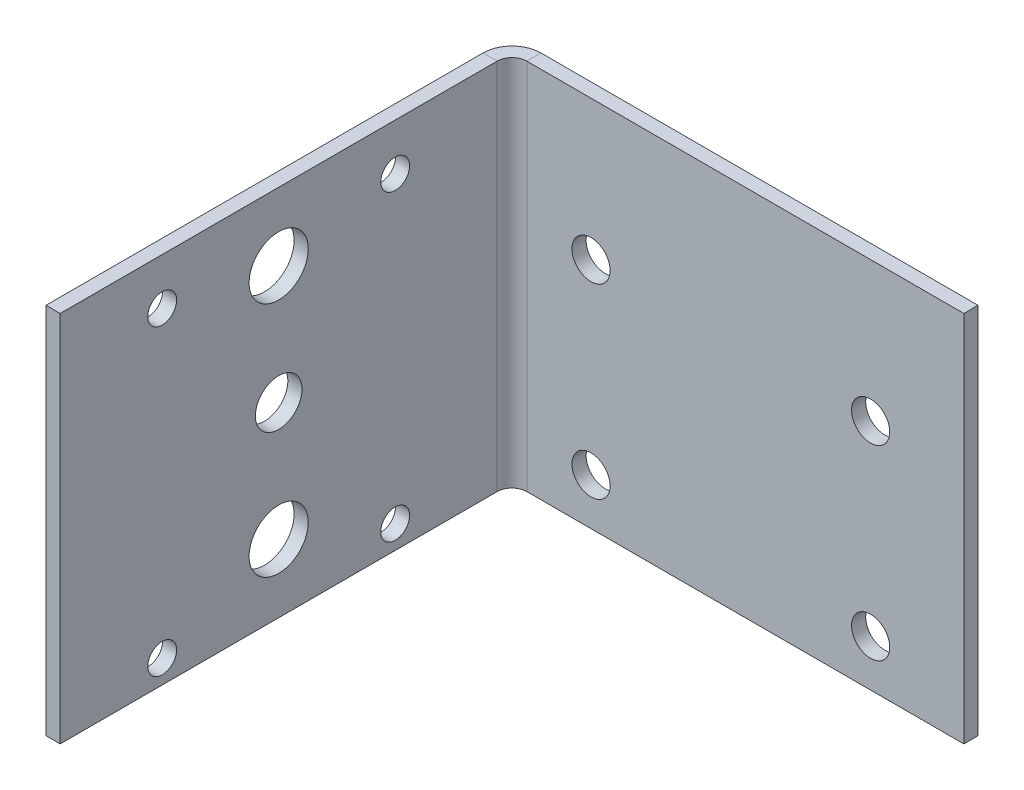
ISO-10303-21;
HEADER;
FILE_DESCRIPTION(('STEP AP214'),'2;1');
FILE_NAME('part.step','',(''),(''),'','','');
FILE_SCHEMA(('AUTOMOTIVE_DESIGN { 1 0 10303 214 1 1 1 1 }'));
ENDSEC;
DATA;
#1=APPLICATION_CONTEXT('core data for automotive mechanical design processes');
#2=APPLICATION_PROTOCOL_DEFINITION('international standard','automotive_design',2000,#1);
#3=PRODUCT_CONTEXT('',#1,'mechanical');
#4=PRODUCT('Part','Part','',(#3));
#5=PRODUCT_RELATED_PRODUCT_CATEGORY('part','',(#4));
#6=PRODUCT_DEFINITION_FORMATION('','',#4);
#7=PRODUCT_DEFINITION_CONTEXT('part definition',#1,'design');
#8=PRODUCT_DEFINITION('design','',#6,#7);
#9=PRODUCT_DEFINITION_SHAPE('','',#8);
#10=(LENGTH_UNIT() NAMED_UNIT(*) SI_UNIT(.MILLI.,.METRE.));
#11=(NAMED_UNIT(*) PLANE_ANGLE_UNIT() SI_UNIT($,.RADIAN.));
#12=(NAMED_UNIT(*) SI_UNIT($,.STERADIAN.) SOLID_ANGLE_UNIT());
#13=UNCERTAINTY_MEASURE_WITH_UNIT(LENGTH_MEASURE(1.E-05),#10,'distance_accuracy_value','');
#14=(GEOMETRIC_REPRESENTATION_CONTEXT(3) GLOBAL_UNCERTAINTY_ASSIGNED_CONTEXT((#13)) GLOBAL_UNIT_ASSIGNED_CONTEXT((#10,
#11,#12)) REPRESENTATION_CONTEXT('',''));
#15=CARTESIAN_POINT('',(0.,0.,0.));
#16=DIRECTION('',(0.,0.,1.));
#17=DIRECTION('',(1.,0.,0.));
#18=AXIS2_PLACEMENT_3D('',#15,#16,#17);
#19=CARTESIAN_POINT('',(-50.,-40.,-3.03784));
#20=DIRECTION('',(0.,-1.,0.));
#21=DIRECTION('',(0.,0.,-1.));
#22=AXIS2_PLACEMENT_3D('',#19,#20,#21);
#23=PLANE('',#22);
#24=DIRECTION('',(1.,0.,0.));
#25=VECTOR('',#24,1.);
#26=CARTESIAN_POINT('',(-50.,-40.,0.));
#27=LINE('',#26,#25);
#28=CARTESIAN_POINT('',(-43.78716,-40.,0.));
#29=VERTEX_POINT('',#28);
#30=CARTESIAN_POINT('',(50.,-40.,0.));
#31=VERTEX_POINT('',#30);
#32=EDGE_CURVE('E94',#29,#31,#27,.T.);
#33=ORIENTED_EDGE('',*,*,#32,.F.);
#34=DIRECTION('',(0.,0.,-1.));
#35=VECTOR('',#34,1.);
#36=CARTESIAN_POINT('',(-43.78716,-40.,0.));
#37=LINE('',#36,#35);
#38=CARTESIAN_POINT('',(-43.78716,-40.,-3.03784));
#39=VERTEX_POINT('',#38);
#40=EDGE_CURVE('E139',#29,#39,#37,.T.);
#41=ORIENTED_EDGE('',*,*,#40,.T.);
#42=DIRECTION('',(1.,0.,0.));
#43=VECTOR('',#42,1.);
#44=CARTESIAN_POINT('',(-50.,-40.,-3.03784));
#45=LINE('',#44,#43);
#46=CARTESIAN_POINT('',(50.,-40.,-3.03784));
#47=VERTEX_POINT('',#46);
#48=EDGE_CURVE('E83',#39,#47,#45,.T.);
#49=ORIENTED_EDGE('',*,*,#48,.T.);
#50=DIRECTION('',(0.,0.,1.));
#51=VECTOR('',#50,1.);
#52=CARTESIAN_POINT('',(50.,-40.,-3.03784));
#53=LINE('',#52,#51);
#54=EDGE_CURVE('E13',#47,#31,#53,.T.);
#55=ORIENTED_EDGE('',*,*,#54,.T.);
#56=EDGE_LOOP('',(#33,#41,#49,#55));
#57=FACE_BOUND('',#56,.T.);
#58=ADVANCED_FACE('F60',(#57),#23,.T.);
#59=CARTESIAN_POINT('',(0.,0.,-3.03784));
#60=DIRECTION('',(0.,0.,1.));
#61=DIRECTION('',(1.,0.,0.));
#62=AXIS2_PLACEMENT_3D('',#59,#60,#61);
#63=PLANE('',#62);
#64=CARTESIAN_POINT('',(-30.,10.,-3.03784));
#65=DIRECTION('',(0.,0.,1.));
#66=DIRECTION('',(1.,0.,0.));
#67=AXIS2_PLACEMENT_3D('',#64,#65,#66);
#68=CIRCLE('',#67,4.1);
#69=CARTESIAN_POINT('',(-25.9,10.,-3.03784));
#70=VERTEX_POINT('',#69);
#71=EDGE_CURVE('E106',#70,#70,#68,.T.);
#72=ORIENTED_EDGE('',*,*,#71,.T.);
#73=EDGE_LOOP('',(#72));
#74=FACE_BOUND('',#73,.T.);
#75=CARTESIAN_POINT('',(30.,10.,-3.03784));
#76=DIRECTION('',(0.,0.,1.));
#77=DIRECTION('',(1.,0.,0.));
#78=AXIS2_PLACEMENT_3D('',#75,#76,#77);
#79=CIRCLE('',#78,4.1);
#80=CARTESIAN_POINT('',(34.1,10.,-3.03784));
#81=VERTEX_POINT('',#80);
#82=EDGE_CURVE('E119',#81,#81,#79,.T.);
#83=ORIENTED_EDGE('',*,*,#82,.T.);
#84=EDGE_LOOP('',(#83));
#85=FACE_BOUND('',#84,.T.);
#86=CARTESIAN_POINT('',(-30.,-30.,-3.03784));
#87=DIRECTION('',(0.,0.,1.));
#88=DIRECTION('',(1.,0.,0.));
#89=AXIS2_PLACEMENT_3D('',#86,#87,#88);
#90=CIRCLE('',#89,4.1);
#91=CARTESIAN_POINT('',(-25.9,-30.,-3.03784));
#92=VERTEX_POINT('',#91);
#93=EDGE_CURVE('E124',#92,#92,#90,.T.);
#94=ORIENTED_EDGE('',*,*,#93,.T.);
#95=EDGE_LOOP('',(#94));
#96=FACE_BOUND('',#95,.T.);
#97=CARTESIAN_POINT('',(30.,-30.,-3.03784));
#98=DIRECTION('',(0.,0.,1.));
#99=DIRECTION('',(1.,0.,0.));
#100=AXIS2_PLACEMENT_3D('',#97,#98,#99);
#101=CIRCLE('',#100,4.1);
#102=CARTESIAN_POINT('',(34.1,-30.,-3.03784));
#103=VERTEX_POINT('',#102);
#104=EDGE_CURVE('E130',#103,#103,#101,.T.);
#105=ORIENTED_EDGE('',*,*,#104,.T.);
#106=EDGE_LOOP('',(#105));
#107=FACE_BOUND('',#106,.T.);
#108=DIRECTION('',(0.,-1.,0.));
#109=VECTOR('',#108,1.);
#110=CARTESIAN_POINT('',(-43.78716,-40.,-3.03784));
#111=LINE('',#110,#109);
#112=CARTESIAN_POINT('',(-43.78716,40.,-3.03784));
#113=VERTEX_POINT('',#112);
#114=EDGE_CURVE('E155',#39,#113,#111,.F.);
#115=ORIENTED_EDGE('',*,*,#114,.T.);
#116=DIRECTION('',(-1.,0.,0.));
#117=VECTOR('',#116,1.);
#118=CARTESIAN_POINT('',(-50.,40.,-3.03784));
#119=LINE('',#118,#117);
#120=CARTESIAN_POINT('',(50.,40.,-3.03784));
#121=VERTEX_POINT('',#120);
#122=EDGE_CURVE('E114',#121,#113,#119,.T.);
#123=ORIENTED_EDGE('',*,*,#122,.F.);
#124=DIRECTION('',(0.,1.,0.));
#125=VECTOR('',#124,1.);
#126=CARTESIAN_POINT('',(50.,40.,-3.03784));
#127=LINE('',#126,#125);
#128=EDGE_CURVE('E99',#47,#121,#127,.T.);
#129=ORIENTED_EDGE('',*,*,#128,.F.);
#130=ORIENTED_EDGE('',*,*,#48,.F.);
#131=EDGE_LOOP('',(#115,#123,#129,#130));
#132=FACE_BOUND('',#131,.T.);
#133=ADVANCED_FACE('F291',(#74,#85,#96,#107,#132),#63,.F.);
#134=CARTESIAN_POINT('',(0.,0.,0.));
#135=DIRECTION('',(0.,0.,1.));
#136=DIRECTION('',(1.,0.,0.));
#137=AXIS2_PLACEMENT_3D('',#134,#135,#136);
#138=PLANE('',#137);
#139=CARTESIAN_POINT('',(30.,-30.,0.));
#140=DIRECTION('',(0.,0.,1.));
#141=DIRECTION('',(1.,0.,0.));
#142=AXIS2_PLACEMENT_3D('',#139,#140,#141);
#143=CIRCLE('',#142,4.1);
#144=CARTESIAN_POINT('',(34.1,-30.,0.));
#145=VERTEX_POINT('',#144);
#146=EDGE_CURVE('E133',#145,#145,#143,.T.);
#147=ORIENTED_EDGE('',*,*,#146,.F.);
#148=EDGE_LOOP('',(#147));
#149=FACE_BOUND('',#148,.T.);
#150=CARTESIAN_POINT('',(-30.,-30.,0.));
#151=DIRECTION('',(0.,0.,1.));
#152=DIRECTION('',(1.,0.,0.));
#153=AXIS2_PLACEMENT_3D('',#150,#151,#152);
#154=CIRCLE('',#153,4.1);
#155=CARTESIAN_POINT('',(-25.9,-30.,0.));
#156=VERTEX_POINT('',#155);
#157=EDGE_CURVE('E127',#156,#156,#154,.T.);
#158=ORIENTED_EDGE('',*,*,#157,.F.);
#159=EDGE_LOOP('',(#158));
#160=FACE_BOUND('',#159,.T.);
#161=CARTESIAN_POINT('',(30.,10.,0.));
#162=DIRECTION('',(0.,0.,1.));
#163=DIRECTION('',(1.,0.,0.));
#164=AXIS2_PLACEMENT_3D('',#161,#162,#163);
#165=CIRCLE('',#164,4.1);
#166=CARTESIAN_POINT('',(34.1,10.,0.));
#167=VERTEX_POINT('',#166);
#168=EDGE_CURVE('E121',#167,#167,#165,.T.);
#169=ORIENTED_EDGE('',*,*,#168,.F.);
#170=EDGE_LOOP('',(#169));
#171=FACE_BOUND('',#170,.T.);
#172=CARTESIAN_POINT('',(-30.,10.,0.));
#173=DIRECTION('',(0.,0.,1.));
#174=DIRECTION('',(1.,0.,0.));
#175=AXIS2_PLACEMENT_3D('',#172,#173,#174);
#176=CIRCLE('',#175,4.1);
#177=CARTESIAN_POINT('',(-25.9,10.,0.));
#178=VERTEX_POINT('',#177);
#179=EDGE_CURVE('E110',#178,#178,#176,.T.);
#180=ORIENTED_EDGE('',*,*,#179,.F.);
#181=EDGE_LOOP('',(#180));
#182=FACE_BOUND('',#181,.T.);
#183=DIRECTION('',(-1.,0.,0.));
#184=VECTOR('',#183,1.);
#185=CARTESIAN_POINT('',(-50.,40.,0.));
#186=LINE('',#185,#184);
#187=CARTESIAN_POINT('',(50.,40.,0.));
#188=VERTEX_POINT('',#187);
#189=CARTESIAN_POINT('',(-43.78716,40.,0.));
#190=VERTEX_POINT('',#189);
#191=EDGE_CURVE('E100',#188,#190,#186,.T.);
#192=ORIENTED_EDGE('',*,*,#191,.T.);
#193=DIRECTION('',(0.,-1.,0.));
#194=VECTOR('',#193,1.);
#195=CARTESIAN_POINT('',(-43.78716,-40.,0.));
#196=LINE('',#195,#194);
#197=EDGE_CURVE('E75',#29,#190,#196,.F.);
#198=ORIENTED_EDGE('',*,*,#197,.F.);
#199=ORIENTED_EDGE('',*,*,#32,.T.);
#200=DIRECTION('',(0.,1.,0.));
#201=VECTOR('',#200,1.);
#202=CARTESIAN_POINT('',(50.,40.,0.));
#203=LINE('',#202,#201);
#204=EDGE_CURVE('E97',#31,#188,#203,.T.);
#205=ORIENTED_EDGE('',*,*,#204,.T.);
#206=EDGE_LOOP('',(#192,#198,#199,#205));
#207=FACE_BOUND('',#206,.T.);
#208=ADVANCED_FACE('F95',(#149,#160,#171,#182,#207),#138,.T.);
#209=CARTESIAN_POINT('',(50.,40.,-3.03784));
#210=DIRECTION('',(1.,0.,0.));
#211=DIRECTION('',(0.,1.,0.));
#212=AXIS2_PLACEMENT_3D('',#209,#210,#211);
#213=PLANE('',#212);
#214=ORIENTED_EDGE('',*,*,#204,.F.);
#215=ORIENTED_EDGE('',*,*,#54,.F.);
#216=ORIENTED_EDGE('',*,*,#128,.T.);
#217=DIRECTION('',(0.,0.,1.));
#218=VECTOR('',#217,1.);
#219=CARTESIAN_POINT('',(50.,40.,-3.03784));
#220=LINE('',#219,#218);
#221=EDGE_CURVE('E64',#121,#188,#220,.T.);
#222=ORIENTED_EDGE('',*,*,#221,.T.);
#223=EDGE_LOOP('',(#214,#215,#216,#222));
#224=FACE_BOUND('',#223,.T.);
#225=ADVANCED_FACE('F62',(#224),#213,.T.);
#226=CARTESIAN_POINT('',(-50.,40.,-3.03784));
#227=DIRECTION('',(0.,1.,0.));
#228=DIRECTION('',(0.,0.,1.));
#229=AXIS2_PLACEMENT_3D('',#226,#227,#228);
#230=PLANE('',#229);
#231=DIRECTION('',(0.,0.,-1.));
#232=VECTOR('',#231,1.);
#233=CARTESIAN_POINT('',(-43.78716,40.,0.));
#234=LINE('',#233,#232);
#235=EDGE_CURVE('E136',#190,#113,#234,.T.);
#236=ORIENTED_EDGE('',*,*,#235,.F.);
#237=ORIENTED_EDGE('',*,*,#191,.F.);
#238=ORIENTED_EDGE('',*,*,#221,.F.);
#239=ORIENTED_EDGE('',*,*,#122,.T.);
#240=EDGE_LOOP('',(#236,#237,#238,#239));
#241=FACE_BOUND('',#240,.T.);
#242=ADVANCED_FACE('F293',(#241),#230,.T.);
#243=CARTESIAN_POINT('',(-30.,10.,-3.03784));
#244=DIRECTION('',(0.,0.,1.));
#245=DIRECTION('',(1.,0.,0.));
#246=AXIS2_PLACEMENT_3D('',#243,#244,#245);
#247=CYLINDRICAL_SURFACE('',#246,4.1);
#248=ORIENTED_EDGE('',*,*,#71,.F.);
#249=EDGE_LOOP('',(#248));
#250=FACE_BOUND('',#249,.T.);
#251=ORIENTED_EDGE('',*,*,#179,.T.);
#252=EDGE_LOOP('',(#251));
#253=FACE_BOUND('',#252,.T.);
#254=ADVANCED_FACE('F321',(#250,#253),#247,.F.);
#255=CARTESIAN_POINT('',(30.,10.,-3.03784));
#256=DIRECTION('',(0.,0.,1.));
#257=DIRECTION('',(1.,0.,0.));
#258=AXIS2_PLACEMENT_3D('',#255,#256,#257);
#259=CYLINDRICAL_SURFACE('',#258,4.1);
#260=ORIENTED_EDGE('',*,*,#82,.F.);
#261=EDGE_LOOP('',(#260));
#262=FACE_BOUND('',#261,.T.);
#263=ORIENTED_EDGE('',*,*,#168,.T.);
#264=EDGE_LOOP('',(#263));
#265=FACE_BOUND('',#264,.T.);
#266=ADVANCED_FACE('F326',(#262,#265),#259,.F.);
#267=CARTESIAN_POINT('',(-30.,-30.,-3.03784));
#268=DIRECTION('',(0.,0.,1.));
#269=DIRECTION('',(1.,0.,0.));
#270=AXIS2_PLACEMENT_3D('',#267,#268,#269);
#271=CYLINDRICAL_SURFACE('',#270,4.1);
#272=ORIENTED_EDGE('',*,*,#93,.F.);
#273=EDGE_LOOP('',(#272));
#274=FACE_BOUND('',#273,.T.);
#275=ORIENTED_EDGE('',*,*,#157,.T.);
#276=EDGE_LOOP('',(#275));
#277=FACE_BOUND('',#276,.T.);
#278=ADVANCED_FACE('F345',(#274,#277),#271,.F.);
#279=CARTESIAN_POINT('',(30.,-30.,-3.03784));
#280=DIRECTION('',(0.,0.,1.));
#281=DIRECTION('',(1.,0.,0.));
#282=AXIS2_PLACEMENT_3D('',#279,#280,#281);
#283=CYLINDRICAL_SURFACE('',#282,4.1);
#284=ORIENTED_EDGE('',*,*,#104,.F.);
#285=EDGE_LOOP('',(#284));
#286=FACE_BOUND('',#285,.T.);
#287=ORIENTED_EDGE('',*,*,#146,.T.);
#288=EDGE_LOOP('',(#287));
#289=FACE_BOUND('',#288,.T.);
#290=ADVANCED_FACE('F351',(#286,#289),#283,.F.);
#291=CARTESIAN_POINT('',(-43.78716,40.,3.175));
#292=DIRECTION('',(0.,1.,0.));
#293=DIRECTION('',(0.,0.,1.));
#294=AXIS2_PLACEMENT_3D('',#291,#292,#293);
#295=PLANE('',#294);
#296=DIRECTION('',(1.,0.,0.));
#297=VECTOR('',#296,1.);
#298=CARTESIAN_POINT('',(-50.,40.,3.17499999999998));
#299=LINE('',#298,#297);
#300=CARTESIAN_POINT('',(-46.96216,40.,3.17499999999999));
#301=VERTEX_POINT('',#300);
#302=CARTESIAN_POINT('',(-50.,40.,3.17499999999998));
#303=VERTEX_POINT('',#302);
#304=EDGE_CURVE('E160',#301,#303,#299,.F.);
#305=ORIENTED_EDGE('',*,*,#304,.F.);
#306=CARTESIAN_POINT('',(-43.78716,40.,3.175));
#307=DIRECTION('',(0.,-1.,0.));
#308=DIRECTION('',(0.,0.,-1.));
#309=AXIS2_PLACEMENT_3D('',#306,#307,#308);
#310=CIRCLE('',#309,3.175);
#311=EDGE_CURVE('E149',#190,#301,#310,.F.);
#312=ORIENTED_EDGE('',*,*,#311,.F.);
#313=ORIENTED_EDGE('',*,*,#235,.T.);
#314=CARTESIAN_POINT('',(-43.78716,40.,3.175));
#315=DIRECTION('',(0.,-1.,0.));
#316=DIRECTION('',(0.,0.,-1.));
#317=AXIS2_PLACEMENT_3D('',#314,#315,#316);
#318=CIRCLE('',#317,6.21284);
#319=EDGE_CURVE('E141',#113,#303,#318,.F.);
#320=ORIENTED_EDGE('',*,*,#319,.T.);
#321=EDGE_LOOP('',(#305,#312,#313,#320));
#322=FACE_BOUND('',#321,.T.);
#323=ADVANCED_FACE('F296',(#322),#295,.T.);
#324=CARTESIAN_POINT('',(-43.78716,-40.,3.175));
#325=DIRECTION('',(0.,1.,0.));
#326=DIRECTION('',(0.,0.,1.));
#327=AXIS2_PLACEMENT_3D('',#324,#325,#326);
#328=PLANE('',#327);
#329=CARTESIAN_POINT('',(-43.78716,-40.,3.175));
#330=DIRECTION('',(0.,-1.,0.));
#331=DIRECTION('',(0.,0.,-1.));
#332=AXIS2_PLACEMENT_3D('',#329,#330,#331);
#333=CIRCLE('',#332,3.175);
#334=CARTESIAN_POINT('',(-46.96216,-40.,3.17499999999999));
#335=VERTEX_POINT('',#334);
#336=EDGE_CURVE('E144',#335,#29,#333,.T.);
#337=ORIENTED_EDGE('',*,*,#336,.F.);
#338=DIRECTION('',(1.,0.,0.));
#339=VECTOR('',#338,1.);
#340=CARTESIAN_POINT('',(-46.96216,-40.,3.17499999999999));
#341=LINE('',#340,#339);
#342=CARTESIAN_POINT('',(-50.,-40.,3.17499999999998));
#343=VERTEX_POINT('',#342);
#344=EDGE_CURVE('E167',#335,#343,#341,.F.);
#345=ORIENTED_EDGE('',*,*,#344,.T.);
#346=CARTESIAN_POINT('',(-43.78716,-40.,3.175));
#347=DIRECTION('',(0.,-1.,0.));
#348=DIRECTION('',(0.,0.,-1.));
#349=AXIS2_PLACEMENT_3D('',#346,#347,#348);
#350=CIRCLE('',#349,6.21284);
#351=EDGE_CURVE('E152',#343,#39,#350,.T.);
#352=ORIENTED_EDGE('',*,*,#351,.T.);
#353=ORIENTED_EDGE('',*,*,#40,.F.);
#354=EDGE_LOOP('',(#337,#345,#352,#353));
#355=FACE_BOUND('',#354,.T.);
#356=ADVANCED_FACE('F300',(#355),#328,.F.);
#357=CARTESIAN_POINT('',(-43.78716,-40.,3.175));
#358=DIRECTION('',(0.,-1.,0.));
#359=DIRECTION('',(-1.,0.,0.));
#360=AXIS2_PLACEMENT_3D('',#357,#358,#359);
#361=CYLINDRICAL_SURFACE('',#360,6.21284);
#362=ORIENTED_EDGE('',*,*,#114,.F.);
#363=ORIENTED_EDGE('',*,*,#351,.F.);
#364=DIRECTION('',(0.,-1.,0.));
#365=VECTOR('',#364,1.);
#366=CARTESIAN_POINT('',(-50.,40.,3.17499999999998));
#367=LINE('',#366,#365);
#368=EDGE_CURVE('E170',#343,#303,#367,.F.);
#369=ORIENTED_EDGE('',*,*,#368,.T.);
#370=ORIENTED_EDGE('',*,*,#319,.F.);
#371=EDGE_LOOP('',(#362,#363,#369,#370));
#372=FACE_BOUND('',#371,.T.);
#373=ADVANCED_FACE('F297',(#372),#361,.T.);
#374=CARTESIAN_POINT('',(-43.78716,-40.,3.175));
#375=DIRECTION('',(0.,-1.,0.));
#376=DIRECTION('',(-1.,0.,0.));
#377=AXIS2_PLACEMENT_3D('',#374,#375,#376);
#378=CYLINDRICAL_SURFACE('',#377,3.175);
#379=ORIENTED_EDGE('',*,*,#197,.T.);
#380=ORIENTED_EDGE('',*,*,#311,.T.);
#381=DIRECTION('',(0.,-1.,0.));
#382=VECTOR('',#381,1.);
#383=CARTESIAN_POINT('',(-46.96216,40.,3.17499999999999));
#384=LINE('',#383,#382);
#385=EDGE_CURVE('E163',#301,#335,#384,.T.);
#386=ORIENTED_EDGE('',*,*,#385,.T.);
#387=ORIENTED_EDGE('',*,*,#336,.T.);
#388=EDGE_LOOP('',(#379,#380,#386,#387));
#389=FACE_BOUND('',#388,.T.);
#390=ADVANCED_FACE('F299',(#389),#378,.F.);
#391=CARTESIAN_POINT('',(-50.,40.,0.));
#392=DIRECTION('',(0.,-1.,0.));
#393=DIRECTION('',(1.,0.,0.));
#394=AXIS2_PLACEMENT_3D('',#391,#392,#393);
#395=PLANE('',#394);
#396=ORIENTED_EDGE('',*,*,#304,.T.);
#397=DIRECTION('',(0.,0.,-1.));
#398=VECTOR('',#397,1.);
#399=CARTESIAN_POINT('',(-50.,40.,-1.88798196641487E-13));
#400=LINE('',#399,#398);
#401=CARTESIAN_POINT('',(-50.0000000000003,40.,96.96216));
#402=VERTEX_POINT('',#401);
#403=EDGE_CURVE('E182',#402,#303,#400,.T.);
#404=ORIENTED_EDGE('',*,*,#403,.F.);
#405=DIRECTION('',(1.,0.,0.));
#406=VECTOR('',#405,1.);
#407=CARTESIAN_POINT('',(-50.0000000000003,40.,96.96216));
#408=LINE('',#407,#406);
#409=CARTESIAN_POINT('',(-46.9621600000003,40.,96.96216));
#410=VERTEX_POINT('',#409);
#411=EDGE_CURVE('E191',#402,#410,#408,.T.);
#412=ORIENTED_EDGE('',*,*,#411,.T.);
#413=DIRECTION('',(0.,0.,1.));
#414=VECTOR('',#413,1.);
#415=CARTESIAN_POINT('',(-46.96216,40.,0.));
#416=LINE('',#415,#414);
#417=EDGE_CURVE('E173',#410,#301,#416,.F.);
#418=ORIENTED_EDGE('',*,*,#417,.T.);
#419=EDGE_LOOP('',(#396,#404,#412,#418));
#420=FACE_BOUND('',#419,.T.);
#421=ADVANCED_FACE('F306',(#420),#395,.F.);
#422=CARTESIAN_POINT('',(-50.0000000000003,-40.,96.96216));
#423=DIRECTION('',(0.,1.,0.));
#424=DIRECTION('',(-1.,0.,0.));
#425=AXIS2_PLACEMENT_3D('',#422,#423,#424);
#426=PLANE('',#425);
#427=ORIENTED_EDGE('',*,*,#344,.F.);
#428=DIRECTION('',(0.,0.,-1.));
#429=VECTOR('',#428,1.);
#430=CARTESIAN_POINT('',(-46.9621600000003,-40.,96.96216));
#431=LINE('',#430,#429);
#432=CARTESIAN_POINT('',(-46.9621600000003,-40.,96.96216));
#433=VERTEX_POINT('',#432);
#434=EDGE_CURVE('E176',#335,#433,#431,.F.);
#435=ORIENTED_EDGE('',*,*,#434,.T.);
#436=DIRECTION('',(1.,0.,0.));
#437=VECTOR('',#436,1.);
#438=CARTESIAN_POINT('',(-50.0000000000003,-40.,96.96216));
#439=LINE('',#438,#437);
#440=CARTESIAN_POINT('',(-50.0000000000003,-40.,96.96216));
#441=VERTEX_POINT('',#440);
#442=EDGE_CURVE('E147',#441,#433,#439,.T.);
#443=ORIENTED_EDGE('',*,*,#442,.F.);
#444=DIRECTION('',(0.,0.,1.));
#445=VECTOR('',#444,1.);
#446=CARTESIAN_POINT('',(-50.,-40.,-1.83073164192616E-13));
#447=LINE('',#446,#445);
#448=EDGE_CURVE('E185',#343,#441,#447,.T.);
#449=ORIENTED_EDGE('',*,*,#448,.F.);
#450=EDGE_LOOP('',(#427,#435,#443,#449));
#451=FACE_BOUND('',#450,.T.);
#452=ADVANCED_FACE('F244',(#451),#426,.F.);
#453=CARTESIAN_POINT('',(-50.,0.,-1.85935680417052E-13));
#454=DIRECTION('',(1.,0.,0.));
#455=DIRECTION('',(0.,0.,-1.));
#456=AXIS2_PLACEMENT_3D('',#453,#454,#455);
#457=PLANE('',#456);
#458=CARTESIAN_POINT('',(-50.0000000000001,-35.,25.06858));
#459=DIRECTION('',(-1.,0.,0.));
#460=DIRECTION('',(0.,0.,1.));
#461=AXIS2_PLACEMENT_3D('',#458,#459,#460);
#462=CIRCLE('',#461,3.1);
#463=CARTESIAN_POINT('',(-50.0000000000001,-35.,28.16858));
#464=VERTEX_POINT('',#463);
#465=EDGE_CURVE('E217',#464,#464,#462,.T.);
#466=ORIENTED_EDGE('',*,*,#465,.F.);
#467=EDGE_LOOP('',(#466));
#468=FACE_BOUND('',#467,.T.);
#469=CARTESIAN_POINT('',(-50.0000000000002,30.,75.06858));
#470=DIRECTION('',(-1.,0.,0.));
#471=DIRECTION('',(0.,0.,1.));
#472=AXIS2_PLACEMENT_3D('',#469,#470,#471);
#473=CIRCLE('',#472,3.1);
#474=CARTESIAN_POINT('',(-50.0000000000003,30.,78.16858));
#475=VERTEX_POINT('',#474);
#476=EDGE_CURVE('E206',#475,#475,#473,.T.);
#477=ORIENTED_EDGE('',*,*,#476,.F.);
#478=EDGE_LOOP('',(#477));
#479=FACE_BOUND('',#478,.T.);
#480=CARTESIAN_POINT('',(-50.0000000000001,30.,25.06858));
#481=DIRECTION('',(-1.,0.,0.));
#482=DIRECTION('',(0.,0.,1.));
#483=AXIS2_PLACEMENT_3D('',#480,#481,#482);
#484=CIRCLE('',#483,3.1);
#485=CARTESIAN_POINT('',(-50.0000000000001,30.,28.16858));
#486=VERTEX_POINT('',#485);
#487=EDGE_CURVE('E205',#486,#486,#484,.T.);
#488=ORIENTED_EDGE('',*,*,#487,.F.);
#489=EDGE_LOOP('',(#488));
#490=FACE_BOUND('',#489,.T.);
#491=CARTESIAN_POINT('',(-50.0000000000001,-25.4,50.06858));
#492=DIRECTION('',(-1.,0.,0.));
#493=DIRECTION('',(0.,0.,1.));
#494=AXIS2_PLACEMENT_3D('',#491,#492,#493);
#495=CIRCLE('',#494,6.35);
#496=CARTESIAN_POINT('',(-50.0000000000002,-25.4,56.41858));
#497=VERTEX_POINT('',#496);
#498=EDGE_CURVE('E199',#497,#497,#495,.T.);
#499=ORIENTED_EDGE('',*,*,#498,.F.);
#500=EDGE_LOOP('',(#499));
#501=FACE_BOUND('',#500,.T.);
#502=CARTESIAN_POINT('',(-50.0000000000002,-35.,75.06858));
#503=DIRECTION('',(-1.,0.,0.));
#504=DIRECTION('',(0.,0.,1.));
#505=AXIS2_PLACEMENT_3D('',#502,#503,#504);
#506=CIRCLE('',#505,3.1);
#507=CARTESIAN_POINT('',(-50.0000000000003,-35.,78.16858));
#508=VERTEX_POINT('',#507);
#509=EDGE_CURVE('E218',#508,#508,#506,.T.);
#510=ORIENTED_EDGE('',*,*,#509,.F.);
#511=EDGE_LOOP('',(#510));
#512=FACE_BOUND('',#511,.T.);
#513=CARTESIAN_POINT('',(-50.0000000000002,0.,50.06858));
#514=DIRECTION('',(-1.,0.,0.));
#515=DIRECTION('',(0.,0.,1.));
#516=AXIS2_PLACEMENT_3D('',#513,#514,#515);
#517=CIRCLE('',#516,5.);
#518=CARTESIAN_POINT('',(-50.0000000000002,0.,55.06858));
#519=VERTEX_POINT('',#518);
#520=EDGE_CURVE('E229',#519,#519,#517,.T.);
#521=ORIENTED_EDGE('',*,*,#520,.F.);
#522=EDGE_LOOP('',(#521));
#523=FACE_BOUND('',#522,.T.);
#524=CARTESIAN_POINT('',(-50.0000000000002,25.4,50.06858));
#525=DIRECTION('',(-1.,0.,0.));
#526=DIRECTION('',(0.,0.,1.));
#527=AXIS2_PLACEMENT_3D('',#524,#525,#526);
#528=CIRCLE('',#527,6.35);
#529=CARTESIAN_POINT('',(-50.0000000000002,25.4,56.41858));
#530=VERTEX_POINT('',#529);
#531=EDGE_CURVE('E164',#530,#530,#528,.T.);
#532=ORIENTED_EDGE('',*,*,#531,.F.);
#533=EDGE_LOOP('',(#532));
#534=FACE_BOUND('',#533,.T.);
#535=ORIENTED_EDGE('',*,*,#368,.F.);
#536=ORIENTED_EDGE('',*,*,#448,.T.);
#537=DIRECTION('',(0.,1.,0.));
#538=VECTOR('',#537,1.);
#539=CARTESIAN_POINT('',(-50.0000000000003,0.,96.96216));
#540=LINE('',#539,#538);
#541=EDGE_CURVE('E188',#441,#402,#540,.T.);
#542=ORIENTED_EDGE('',*,*,#541,.T.);
#543=ORIENTED_EDGE('',*,*,#403,.T.);
#544=EDGE_LOOP('',(#535,#536,#542,#543));
#545=FACE_BOUND('',#544,.T.);
#546=ADVANCED_FACE('F240',(#468,#479,#490,#501,#512,#523,#534,#545),#457,.F.);
#547=CARTESIAN_POINT('',(-46.96216,0.,-1.75329118746661E-13));
#548=DIRECTION('',(1.,0.,0.));
#549=DIRECTION('',(0.,0.,-1.));
#550=AXIS2_PLACEMENT_3D('',#547,#548,#549);
#551=PLANE('',#550);
#552=CARTESIAN_POINT('',(-46.9621600000001,-35.,25.06858));
#553=DIRECTION('',(1.,0.,0.));
#554=DIRECTION('',(0.,0.,-1.));
#555=AXIS2_PLACEMENT_3D('',#552,#553,#554);
#556=CIRCLE('',#555,3.1);
#557=CARTESIAN_POINT('',(-46.9621600000001,-35.,21.96858));
#558=VERTEX_POINT('',#557);
#559=EDGE_CURVE('E214',#558,#558,#556,.F.);
#560=ORIENTED_EDGE('',*,*,#559,.T.);
#561=EDGE_LOOP('',(#560));
#562=FACE_BOUND('',#561,.T.);
#563=CARTESIAN_POINT('',(-46.9621600000002,30.,75.06858));
#564=DIRECTION('',(1.,0.,0.));
#565=DIRECTION('',(0.,0.,-1.));
#566=AXIS2_PLACEMENT_3D('',#563,#564,#565);
#567=CIRCLE('',#566,3.1);
#568=CARTESIAN_POINT('',(-46.9621600000002,30.,71.96858));
#569=VERTEX_POINT('',#568);
#570=EDGE_CURVE('E221',#569,#569,#567,.F.);
#571=ORIENTED_EDGE('',*,*,#570,.T.);
#572=EDGE_LOOP('',(#571));
#573=FACE_BOUND('',#572,.T.);
#574=CARTESIAN_POINT('',(-46.9621600000001,30.,25.06858));
#575=DIRECTION('',(1.,0.,0.));
#576=DIRECTION('',(0.,0.,-1.));
#577=AXIS2_PLACEMENT_3D('',#574,#575,#576);
#578=CIRCLE('',#577,3.1);
#579=CARTESIAN_POINT('',(-46.9621600000001,30.,21.96858));
#580=VERTEX_POINT('',#579);
#581=EDGE_CURVE('E202',#580,#580,#578,.F.);
#582=ORIENTED_EDGE('',*,*,#581,.T.);
#583=EDGE_LOOP('',(#582));
#584=FACE_BOUND('',#583,.T.);
#585=CARTESIAN_POINT('',(-46.9621600000002,-25.4,50.06858));
#586=DIRECTION('',(1.,0.,0.));
#587=DIRECTION('',(0.,0.,-1.));
#588=AXIS2_PLACEMENT_3D('',#585,#586,#587);
#589=CIRCLE('',#588,6.35);
#590=CARTESIAN_POINT('',(-46.9621600000001,-25.4,43.71858));
#591=VERTEX_POINT('',#590);
#592=EDGE_CURVE('E209',#591,#591,#589,.F.);
#593=ORIENTED_EDGE('',*,*,#592,.T.);
#594=EDGE_LOOP('',(#593));
#595=FACE_BOUND('',#594,.T.);
#596=CARTESIAN_POINT('',(-46.9621600000003,-35.,75.06858));
#597=DIRECTION('',(1.,0.,0.));
#598=DIRECTION('',(0.,0.,-1.));
#599=AXIS2_PLACEMENT_3D('',#596,#597,#598);
#600=CIRCLE('',#599,3.1);
#601=CARTESIAN_POINT('',(-46.9621600000002,-35.,71.96858));
#602=VERTEX_POINT('',#601);
#603=EDGE_CURVE('E232',#602,#602,#600,.F.);
#604=ORIENTED_EDGE('',*,*,#603,.T.);
#605=EDGE_LOOP('',(#604));
#606=FACE_BOUND('',#605,.T.);
#607=CARTESIAN_POINT('',(-46.9621600000002,0.,50.06858));
#608=DIRECTION('',(1.,0.,0.));
#609=DIRECTION('',(0.,0.,-1.));
#610=AXIS2_PLACEMENT_3D('',#607,#608,#609);
#611=CIRCLE('',#610,5.);
#612=CARTESIAN_POINT('',(-46.9621600000001,0.,45.06858));
#613=VERTEX_POINT('',#612);
#614=EDGE_CURVE('E226',#613,#613,#611,.F.);
#615=ORIENTED_EDGE('',*,*,#614,.T.);
#616=EDGE_LOOP('',(#615));
#617=FACE_BOUND('',#616,.T.);
#618=CARTESIAN_POINT('',(-46.9621600000002,25.4,50.06858));
#619=DIRECTION('',(1.,0.,0.));
#620=DIRECTION('',(0.,0.,-1.));
#621=AXIS2_PLACEMENT_3D('',#618,#619,#620);
#622=CIRCLE('',#621,6.35);
#623=CARTESIAN_POINT('',(-46.9621600000001,25.4,43.71858));
#624=VERTEX_POINT('',#623);
#625=EDGE_CURVE('E196',#624,#624,#622,.F.);
#626=ORIENTED_EDGE('',*,*,#625,.T.);
#627=EDGE_LOOP('',(#626));
#628=FACE_BOUND('',#627,.T.);
#629=ORIENTED_EDGE('',*,*,#434,.F.);
#630=ORIENTED_EDGE('',*,*,#385,.F.);
#631=ORIENTED_EDGE('',*,*,#417,.F.);
#632=DIRECTION('',(0.,-1.,0.));
#633=VECTOR('',#632,1.);
#634=CARTESIAN_POINT('',(-46.9621600000003,40.,96.96216));
#635=LINE('',#634,#633);
#636=EDGE_CURVE('E179',#433,#410,#635,.F.);
#637=ORIENTED_EDGE('',*,*,#636,.F.);
#638=EDGE_LOOP('',(#629,#630,#631,#637));
#639=FACE_BOUND('',#638,.T.);
#640=ADVANCED_FACE('F243',(#562,#573,#584,#595,#606,#617,#628,#639),#551,.T.);
#641=CARTESIAN_POINT('',(-50.0000000000003,40.,96.96216));
#642=DIRECTION('',(0.,0.,-1.));
#643=DIRECTION('',(-1.,0.,0.));
#644=AXIS2_PLACEMENT_3D('',#641,#642,#643);
#645=PLANE('',#644);
#646=ORIENTED_EDGE('',*,*,#636,.T.);
#647=ORIENTED_EDGE('',*,*,#411,.F.);
#648=ORIENTED_EDGE('',*,*,#541,.F.);
#649=ORIENTED_EDGE('',*,*,#442,.T.);
#650=EDGE_LOOP('',(#646,#647,#648,#649));
#651=FACE_BOUND('',#650,.T.);
#652=ADVANCED_FACE('F274',(#651),#645,.F.);
#653=CARTESIAN_POINT('',(50.0010000000002,25.4,50.0685800000003));
#654=DIRECTION('',(-1.,0.,0.));
#655=DIRECTION('',(0.,0.,1.));
#656=AXIS2_PLACEMENT_3D('',#653,#654,#655);
#657=CYLINDRICAL_SURFACE('',#656,6.35);
#658=ORIENTED_EDGE('',*,*,#625,.F.);
#659=EDGE_LOOP('',(#658));
#660=FACE_BOUND('',#659,.T.);
#661=ORIENTED_EDGE('',*,*,#531,.T.);
#662=EDGE_LOOP('',(#661));
#663=FACE_BOUND('',#662,.T.);
#664=ADVANCED_FACE('F409',(#660,#663),#657,.F.);
#665=CARTESIAN_POINT('',(50.0010000000002,0.,50.0685800000003));
#666=DIRECTION('',(-1.,0.,0.));
#667=DIRECTION('',(0.,0.,1.));
#668=AXIS2_PLACEMENT_3D('',#665,#666,#667);
#669=CYLINDRICAL_SURFACE('',#668,5.);
#670=ORIENTED_EDGE('',*,*,#614,.F.);
#671=EDGE_LOOP('',(#670));
#672=FACE_BOUND('',#671,.T.);
#673=ORIENTED_EDGE('',*,*,#520,.T.);
#674=EDGE_LOOP('',(#673));
#675=FACE_BOUND('',#674,.T.);
#676=ADVANCED_FACE('F435',(#672,#675),#669,.F.);
#677=CARTESIAN_POINT('',(50.0010000000001,-35.,75.0685800000003));
#678=DIRECTION('',(-1.,0.,0.));
#679=DIRECTION('',(0.,0.,1.));
#680=AXIS2_PLACEMENT_3D('',#677,#678,#679);
#681=CYLINDRICAL_SURFACE('',#680,3.1);
#682=ORIENTED_EDGE('',*,*,#603,.F.);
#683=EDGE_LOOP('',(#682));
#684=FACE_BOUND('',#683,.T.);
#685=ORIENTED_EDGE('',*,*,#509,.T.);
#686=EDGE_LOOP('',(#685));
#687=FACE_BOUND('',#686,.T.);
#688=ADVANCED_FACE('F238',(#684,#687),#681,.F.);
#689=CARTESIAN_POINT('',(50.0010000000002,-25.4,50.0685800000003));
#690=DIRECTION('',(-1.,0.,0.));
#691=DIRECTION('',(0.,0.,1.));
#692=AXIS2_PLACEMENT_3D('',#689,#690,#691);
#693=CYLINDRICAL_SURFACE('',#692,6.35);
#694=ORIENTED_EDGE('',*,*,#592,.F.);
#695=EDGE_LOOP('',(#694));
#696=FACE_BOUND('',#695,.T.);
#697=ORIENTED_EDGE('',*,*,#498,.T.);
#698=EDGE_LOOP('',(#697));
#699=FACE_BOUND('',#698,.T.);
#700=ADVANCED_FACE('F456',(#696,#699),#693,.F.);
#701=CARTESIAN_POINT('',(50.0010000000003,30.,25.0685800000003));
#702=DIRECTION('',(-1.,0.,0.));
#703=DIRECTION('',(0.,0.,1.));
#704=AXIS2_PLACEMENT_3D('',#701,#702,#703);
#705=CYLINDRICAL_SURFACE('',#704,3.1);
#706=ORIENTED_EDGE('',*,*,#581,.F.);
#707=EDGE_LOOP('',(#706));
#708=FACE_BOUND('',#707,.T.);
#709=ORIENTED_EDGE('',*,*,#487,.T.);
#710=EDGE_LOOP('',(#709));
#711=FACE_BOUND('',#710,.T.);
#712=ADVANCED_FACE('F467',(#708,#711),#705,.F.);
#713=CARTESIAN_POINT('',(50.0010000000001,30.,75.0685800000003));
#714=DIRECTION('',(-1.,0.,0.));
#715=DIRECTION('',(0.,0.,1.));
#716=AXIS2_PLACEMENT_3D('',#713,#714,#715);
#717=CYLINDRICAL_SURFACE('',#716,3.1);
#718=ORIENTED_EDGE('',*,*,#570,.F.);
#719=EDGE_LOOP('',(#718));
#720=FACE_BOUND('',#719,.T.);
#721=ORIENTED_EDGE('',*,*,#476,.T.);
#722=EDGE_LOOP('',(#721));
#723=FACE_BOUND('',#722,.T.);
#724=ADVANCED_FACE('F478',(#720,#723),#717,.F.);
#725=CARTESIAN_POINT('',(50.0010000000003,-35.,25.0685800000003));
#726=DIRECTION('',(-1.,0.,0.));
#727=DIRECTION('',(0.,0.,1.));
#728=AXIS2_PLACEMENT_3D('',#725,#726,#727);
#729=CYLINDRICAL_SURFACE('',#728,3.1);
#730=ORIENTED_EDGE('',*,*,#559,.F.);
#731=EDGE_LOOP('',(#730));
#732=FACE_BOUND('',#731,.T.);
#733=ORIENTED_EDGE('',*,*,#465,.T.);
#734=EDGE_LOOP('',(#733));
#735=FACE_BOUND('',#734,.T.);
#736=ADVANCED_FACE('F489',(#732,#735),#729,.F.);
#737=CLOSED_SHELL('',(#58,#133,#208,#225,#242,#254,#266,#278,#290,#323,#356,#373,#390,#421,#452,
#546,#640,#652,#664,#676,#688,#700,#712,#724,#736));
#738=MANIFOLD_SOLID_BREP('B2',#737);
#739=ADVANCED_BREP_SHAPE_REPRESENTATION('',(#18,#738),#14);
#740=SHAPE_DEFINITION_REPRESENTATION(#9,#739);
ENDSEC;
END-ISO-10303-21;
